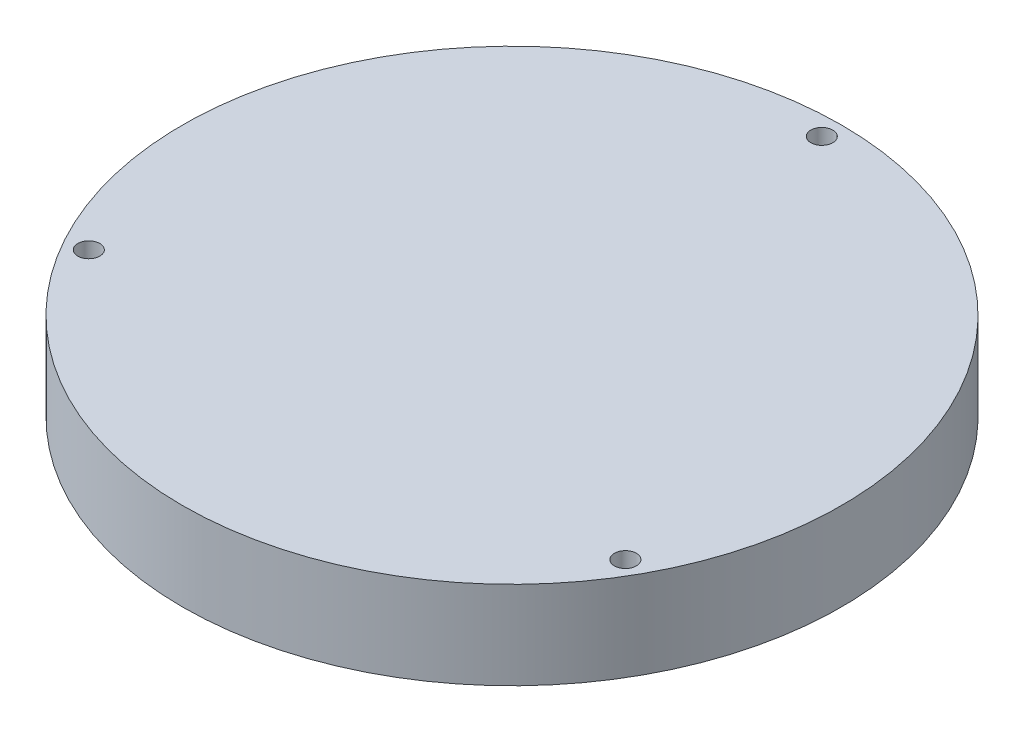
ISO-10303-21;
HEADER;
FILE_DESCRIPTION(('STEP AP214'),'2;1');
FILE_NAME('part.step','',(''),(''),'','','');
FILE_SCHEMA(('AUTOMOTIVE_DESIGN { 1 0 10303 214 1 1 1 1 }'));
ENDSEC;
DATA;
#1=APPLICATION_CONTEXT('core data for automotive mechanical design processes');
#2=APPLICATION_PROTOCOL_DEFINITION('international standard','automotive_design',2000,#1);
#3=PRODUCT_CONTEXT('',#1,'mechanical');
#4=PRODUCT('Part','Part','',(#3));
#5=PRODUCT_RELATED_PRODUCT_CATEGORY('part','',(#4));
#6=PRODUCT_DEFINITION_FORMATION('','',#4);
#7=PRODUCT_DEFINITION_CONTEXT('part definition',#1,'design');
#8=PRODUCT_DEFINITION('design','',#6,#7);
#9=PRODUCT_DEFINITION_SHAPE('','',#8);
#10=(LENGTH_UNIT() NAMED_UNIT(*) SI_UNIT(.MILLI.,.METRE.));
#11=(NAMED_UNIT(*) PLANE_ANGLE_UNIT() SI_UNIT($,.RADIAN.));
#12=(NAMED_UNIT(*) SI_UNIT($,.STERADIAN.) SOLID_ANGLE_UNIT());
#13=UNCERTAINTY_MEASURE_WITH_UNIT(LENGTH_MEASURE(1.E-05),#10,'distance_accuracy_value','');
#14=(GEOMETRIC_REPRESENTATION_CONTEXT(3) GLOBAL_UNCERTAINTY_ASSIGNED_CONTEXT((#13)) GLOBAL_UNIT_ASSIGNED_CONTEXT((#10,
#11,#12)) REPRESENTATION_CONTEXT('',''));
#15=CARTESIAN_POINT('',(0.,0.,0.));
#16=DIRECTION('',(0.,0.,1.));
#17=DIRECTION('',(1.,0.,0.));
#18=AXIS2_PLACEMENT_3D('',#15,#16,#17);
#19=CARTESIAN_POINT('',(0.,12.7,0.));
#20=DIRECTION('',(0.,-1.,0.));
#21=DIRECTION('',(0.,0.,-1.));
#22=AXIS2_PLACEMENT_3D('',#19,#20,#21);
#23=CYLINDRICAL_SURFACE('',#22,95.25);
#24=CARTESIAN_POINT('',(0.,12.7,0.));
#25=DIRECTION('',(0.,1.,0.));
#26=DIRECTION('',(0.,0.,1.));
#27=AXIS2_PLACEMENT_3D('',#24,#25,#26);
#28=CIRCLE('',#27,95.25);
#29=CARTESIAN_POINT('',(0.,12.7,95.25));
#30=VERTEX_POINT('',#29);
#31=EDGE_CURVE('E10',#30,#30,#28,.T.);
#32=ORIENTED_EDGE('',*,*,#31,.F.);
#33=EDGE_LOOP('',(#32));
#34=FACE_BOUND('',#33,.T.);
#35=CARTESIAN_POINT('',(0.,-12.7,0.));
#36=DIRECTION('',(0.,1.,0.));
#37=DIRECTION('',(0.,0.,1.));
#38=AXIS2_PLACEMENT_3D('',#35,#36,#37);
#39=CIRCLE('',#38,95.25);
#40=CARTESIAN_POINT('',(0.,-12.7,95.25));
#41=VERTEX_POINT('',#40);
#42=EDGE_CURVE('E40',#41,#41,#39,.T.);
#43=ORIENTED_EDGE('',*,*,#42,.T.);
#44=EDGE_LOOP('',(#43));
#45=FACE_BOUND('',#44,.T.);
#46=ADVANCED_FACE('F37',(#34,#45),#23,.T.);
#47=CARTESIAN_POINT('',(0.,12.7,0.));
#48=DIRECTION('',(0.,1.,0.));
#49=DIRECTION('',(0.,0.,1.));
#50=AXIS2_PLACEMENT_3D('',#47,#48,#49);
#51=PLANE('',#50);
#52=CARTESIAN_POINT('',(77.5395845278395,12.7,44.7675000000004));
#53=DIRECTION('',(0.,1.,0.));
#54=DIRECTION('',(-0.866025403784436,0.,-0.500000000000004));
#55=AXIS2_PLACEMENT_3D('',#52,#53,#54);
#56=CIRCLE('',#55,3.175);
#57=CARTESIAN_POINT('',(74.789953870824,12.7,43.1800000000004));
#58=VERTEX_POINT('',#57);
#59=EDGE_CURVE('E55',#58,#58,#56,.T.);
#60=ORIENTED_EDGE('',*,*,#59,.F.);
#61=EDGE_LOOP('',(#60));
#62=FACE_BOUND('',#61,.T.);
#63=CARTESIAN_POINT('',(-77.5395845278401,12.7,44.7674999999993));
#64=DIRECTION('',(0.,1.,0.));
#65=DIRECTION('',(0.866025403784443,0.,-0.499999999999992));
#66=AXIS2_PLACEMENT_3D('',#63,#64,#65);
#67=CIRCLE('',#66,3.175);
#68=CARTESIAN_POINT('',(-74.7899538708245,12.7,43.1799999999993));
#69=VERTEX_POINT('',#68);
#70=EDGE_CURVE('E59',#69,#69,#67,.T.);
#71=ORIENTED_EDGE('',*,*,#70,.F.);
#72=EDGE_LOOP('',(#71));
#73=FACE_BOUND('',#72,.T.);
#74=CARTESIAN_POINT('',(0.,12.7,-89.535));
#75=DIRECTION('',(0.,1.,0.));
#76=DIRECTION('',(0.,0.,1.));
#77=AXIS2_PLACEMENT_3D('',#74,#75,#76);
#78=CIRCLE('',#77,3.175);
#79=CARTESIAN_POINT('',(0.,12.7,-86.36));
#80=VERTEX_POINT('',#79);
#81=EDGE_CURVE('E51',#80,#80,#78,.T.);
#82=ORIENTED_EDGE('',*,*,#81,.F.);
#83=EDGE_LOOP('',(#82));
#84=FACE_BOUND('',#83,.T.);
#85=ORIENTED_EDGE('',*,*,#31,.T.);
#86=EDGE_LOOP('',(#85));
#87=FACE_BOUND('',#86,.T.);
#88=ADVANCED_FACE('F106',(#62,#73,#84,#87),#51,.T.);
#89=CARTESIAN_POINT('',(0.,-12.7,0.));
#90=DIRECTION('',(0.,1.,0.));
#91=DIRECTION('',(0.,0.,1.));
#92=AXIS2_PLACEMENT_3D('',#89,#90,#91);
#93=PLANE('',#92);
#94=CARTESIAN_POINT('',(-77.5395845278398,-12.7,-44.7674999999998));
#95=DIRECTION('',(0.,-1.,0.));
#96=DIRECTION('',(-0.866025403784436,0.,0.500000000000004));
#97=AXIS2_PLACEMENT_3D('',#94,#95,#96);
#98=CIRCLE('',#97,2.84479999999999);
#99=CARTESIAN_POINT('',(-80.0032535965258,-12.7,-43.3450999999998));
#100=VERTEX_POINT('',#99);
#101=EDGE_CURVE('E87',#100,#100,#98,.T.);
#102=ORIENTED_EDGE('',*,*,#101,.F.);
#103=EDGE_LOOP('',(#102));
#104=FACE_BOUND('',#103,.T.);
#105=CARTESIAN_POINT('',(6.24500451351651E-13,-12.7,89.535));
#106=DIRECTION('',(0.,-1.,0.));
#107=DIRECTION('',(0.866025403784443,0.,0.499999999999992));
#108=AXIS2_PLACEMENT_3D('',#105,#106,#107);
#109=CIRCLE('',#108,2.84479999999999);
#110=CARTESIAN_POINT('',(2.4636690686866,-12.7,90.9574));
#111=VERTEX_POINT('',#110);
#112=EDGE_CURVE('E88',#111,#111,#109,.T.);
#113=ORIENTED_EDGE('',*,*,#112,.F.);
#114=EDGE_LOOP('',(#113));
#115=FACE_BOUND('',#114,.T.);
#116=CARTESIAN_POINT('',(77.5395845278398,-12.7,-44.7674999999998));
#117=DIRECTION('',(0.,-1.,0.));
#118=DIRECTION('',(0.,0.,-1.));
#119=AXIS2_PLACEMENT_3D('',#116,#117,#118);
#120=CIRCLE('',#119,2.84479999999999);
#121=CARTESIAN_POINT('',(77.5395845278398,-12.7,-47.6122999999998));
#122=VERTEX_POINT('',#121);
#123=EDGE_CURVE('E78',#122,#122,#120,.T.);
#124=ORIENTED_EDGE('',*,*,#123,.F.);
#125=EDGE_LOOP('',(#124));
#126=FACE_BOUND('',#125,.T.);
#127=CARTESIAN_POINT('',(77.5395845278395,-12.7,44.7675000000004));
#128=DIRECTION('',(0.,1.,0.));
#129=DIRECTION('',(-0.866025403784436,0.,-0.500000000000004));
#130=AXIS2_PLACEMENT_3D('',#127,#128,#129);
#131=CIRCLE('',#130,3.175);
#132=CARTESIAN_POINT('',(74.789953870824,-12.7,43.1800000000004));
#133=VERTEX_POINT('',#132);
#134=EDGE_CURVE('E63',#133,#133,#131,.T.);
#135=ORIENTED_EDGE('',*,*,#134,.T.);
#136=EDGE_LOOP('',(#135));
#137=FACE_BOUND('',#136,.T.);
#138=CARTESIAN_POINT('',(-77.5395845278401,-12.7,44.7674999999993));
#139=DIRECTION('',(0.,1.,0.));
#140=DIRECTION('',(0.866025403784443,0.,-0.499999999999992));
#141=AXIS2_PLACEMENT_3D('',#138,#139,#140);
#142=CIRCLE('',#141,3.175);
#143=CARTESIAN_POINT('',(-74.7899538708245,-12.7,43.1799999999993));
#144=VERTEX_POINT('',#143);
#145=EDGE_CURVE('E64',#144,#144,#142,.T.);
#146=ORIENTED_EDGE('',*,*,#145,.T.);
#147=EDGE_LOOP('',(#146));
#148=FACE_BOUND('',#147,.T.);
#149=CARTESIAN_POINT('',(0.,-12.7,-89.535));
#150=DIRECTION('',(0.,1.,0.));
#151=DIRECTION('',(0.,0.,1.));
#152=AXIS2_PLACEMENT_3D('',#149,#150,#151);
#153=CIRCLE('',#152,3.175);
#154=CARTESIAN_POINT('',(0.,-12.7,-86.36));
#155=VERTEX_POINT('',#154);
#156=EDGE_CURVE('E49',#155,#155,#153,.T.);
#157=ORIENTED_EDGE('',*,*,#156,.T.);
#158=EDGE_LOOP('',(#157));
#159=FACE_BOUND('',#158,.T.);
#160=ORIENTED_EDGE('',*,*,#42,.F.);
#161=EDGE_LOOP('',(#160));
#162=FACE_BOUND('',#161,.T.);
#163=ADVANCED_FACE('F102',(#104,#115,#126,#137,#148,#159,#162),#93,.F.);
#164=CARTESIAN_POINT('',(0.,-12.7,-89.535));
#165=DIRECTION('',(0.,1.,0.));
#166=DIRECTION('',(0.,0.,1.));
#167=AXIS2_PLACEMENT_3D('',#164,#165,#166);
#168=CYLINDRICAL_SURFACE('',#167,3.175);
#169=ORIENTED_EDGE('',*,*,#156,.F.);
#170=EDGE_LOOP('',(#169));
#171=FACE_BOUND('',#170,.T.);
#172=ORIENTED_EDGE('',*,*,#81,.T.);
#173=EDGE_LOOP('',(#172));
#174=FACE_BOUND('',#173,.T.);
#175=ADVANCED_FACE('F105',(#171,#174),#168,.F.);
#176=CARTESIAN_POINT('',(-77.5395845278401,-12.7,44.7674999999993));
#177=DIRECTION('',(0.,1.,0.));
#178=DIRECTION('',(0.866025403784443,0.,-0.499999999999992));
#179=AXIS2_PLACEMENT_3D('',#176,#177,#178);
#180=CYLINDRICAL_SURFACE('',#179,3.175);
#181=ORIENTED_EDGE('',*,*,#145,.F.);
#182=EDGE_LOOP('',(#181));
#183=FACE_BOUND('',#182,.T.);
#184=ORIENTED_EDGE('',*,*,#70,.T.);
#185=EDGE_LOOP('',(#184));
#186=FACE_BOUND('',#185,.T.);
#187=ADVANCED_FACE('F133',(#183,#186),#180,.F.);
#188=CARTESIAN_POINT('',(77.5395845278395,-12.7,44.7675000000004));
#189=DIRECTION('',(0.,1.,0.));
#190=DIRECTION('',(-0.866025403784436,0.,-0.500000000000004));
#191=AXIS2_PLACEMENT_3D('',#188,#189,#190);
#192=CYLINDRICAL_SURFACE('',#191,3.175);
#193=ORIENTED_EDGE('',*,*,#134,.F.);
#194=EDGE_LOOP('',(#193));
#195=FACE_BOUND('',#194,.T.);
#196=ORIENTED_EDGE('',*,*,#59,.T.);
#197=EDGE_LOOP('',(#196));
#198=FACE_BOUND('',#197,.T.);
#199=ADVANCED_FACE('F137',(#195,#198),#192,.F.);
#200=CARTESIAN_POINT('',(0.,0.,0.));
#201=DIRECTION('',(0.,1.,0.));
#202=DIRECTION('',(0.,0.,1.));
#203=AXIS2_PLACEMENT_3D('',#200,#201,#202);
#204=PLANE('',#203);
#205=CARTESIAN_POINT('',(77.5395845278398,0.,-44.7674999999998));
#206=DIRECTION('',(0.,1.,0.));
#207=DIRECTION('',(0.,0.,1.));
#208=AXIS2_PLACEMENT_3D('',#205,#206,#207);
#209=CIRCLE('',#208,2.84479999999999);
#210=CARTESIAN_POINT('',(77.5395845278398,0.,-41.9226999999998));
#211=VERTEX_POINT('',#210);
#212=EDGE_CURVE('E68',#211,#211,#209,.F.);
#213=ORIENTED_EDGE('',*,*,#212,.T.);
#214=EDGE_LOOP('',(#213));
#215=FACE_BOUND('',#214,.T.);
#216=ADVANCED_FACE('F141',(#215),#204,.F.);
#217=CARTESIAN_POINT('',(77.5395845278398,8.04630948447792,-44.7674999999998));
#218=DIRECTION('',(0.,-1.,0.));
#219=DIRECTION('',(0.,0.,-1.));
#220=AXIS2_PLACEMENT_3D('',#217,#218,#219);
#221=CYLINDRICAL_SURFACE('',#220,2.84479999999999);
#222=ORIENTED_EDGE('',*,*,#123,.T.);
#223=EDGE_LOOP('',(#222));
#224=FACE_BOUND('',#223,.T.);
#225=ORIENTED_EDGE('',*,*,#212,.F.);
#226=EDGE_LOOP('',(#225));
#227=FACE_BOUND('',#226,.T.);
#228=ADVANCED_FACE('F145',(#224,#227),#221,.F.);
#229=CARTESIAN_POINT('',(0.,0.,0.));
#230=DIRECTION('',(0.,1.,0.));
#231=DIRECTION('',(-0.866025403784443,0.,-0.499999999999992));
#232=AXIS2_PLACEMENT_3D('',#229,#230,#231);
#233=PLANE('',#232);
#234=CARTESIAN_POINT('',(6.24500451351651E-13,0.,89.535));
#235=DIRECTION('',(0.,1.,0.));
#236=DIRECTION('',(-0.866025403784443,0.,-0.499999999999992));
#237=AXIS2_PLACEMENT_3D('',#234,#235,#236);
#238=CIRCLE('',#237,2.84479999999999);
#239=CARTESIAN_POINT('',(-2.46366906868535,0.,88.1126));
#240=VERTEX_POINT('',#239);
#241=EDGE_CURVE('E83',#240,#240,#238,.F.);
#242=ORIENTED_EDGE('',*,*,#241,.T.);
#243=EDGE_LOOP('',(#242));
#244=FACE_BOUND('',#243,.T.);
#245=ADVANCED_FACE('F149',(#244),#233,.F.);
#246=CARTESIAN_POINT('',(6.24500451351651E-13,8.04630948447792,89.535));
#247=DIRECTION('',(0.,-1.,0.));
#248=DIRECTION('',(0.866025403784443,0.,0.499999999999992));
#249=AXIS2_PLACEMENT_3D('',#246,#247,#248);
#250=CYLINDRICAL_SURFACE('',#249,2.84479999999999);
#251=ORIENTED_EDGE('',*,*,#112,.T.);
#252=EDGE_LOOP('',(#251));
#253=FACE_BOUND('',#252,.T.);
#254=ORIENTED_EDGE('',*,*,#241,.F.);
#255=EDGE_LOOP('',(#254));
#256=FACE_BOUND('',#255,.T.);
#257=ADVANCED_FACE('F153',(#253,#256),#250,.F.);
#258=CARTESIAN_POINT('',(0.,0.,0.));
#259=DIRECTION('',(0.,1.,0.));
#260=DIRECTION('',(0.866025403784436,0.,-0.500000000000004));
#261=AXIS2_PLACEMENT_3D('',#258,#259,#260);
#262=PLANE('',#261);
#263=CARTESIAN_POINT('',(-77.5395845278398,0.,-44.7674999999998));
#264=DIRECTION('',(0.,1.,0.));
#265=DIRECTION('',(0.866025403784436,0.,-0.500000000000004));
#266=AXIS2_PLACEMENT_3D('',#263,#264,#265);
#267=CIRCLE('',#266,2.84479999999999);
#268=CARTESIAN_POINT('',(-75.0759154591539,0.,-46.1898999999998));
#269=VERTEX_POINT('',#268);
#270=EDGE_CURVE('E82',#269,#269,#267,.F.);
#271=ORIENTED_EDGE('',*,*,#270,.T.);
#272=EDGE_LOOP('',(#271));
#273=FACE_BOUND('',#272,.T.);
#274=ADVANCED_FACE('F157',(#273),#262,.F.);
#275=CARTESIAN_POINT('',(-77.5395845278398,8.04630948447792,-44.7674999999998));
#276=DIRECTION('',(0.,-1.,0.));
#277=DIRECTION('',(-0.866025403784436,0.,0.500000000000004));
#278=AXIS2_PLACEMENT_3D('',#275,#276,#277);
#279=CYLINDRICAL_SURFACE('',#278,2.84479999999999);
#280=ORIENTED_EDGE('',*,*,#101,.T.);
#281=EDGE_LOOP('',(#280));
#282=FACE_BOUND('',#281,.T.);
#283=ORIENTED_EDGE('',*,*,#270,.F.);
#284=EDGE_LOOP('',(#283));
#285=FACE_BOUND('',#284,.T.);
#286=ADVANCED_FACE('F99',(#282,#285),#279,.F.);
#287=CLOSED_SHELL('',(#46,#88,#163,#175,#187,#199,#216,#228,#245,#257,#274,#286));
#288=MANIFOLD_SOLID_BREP('B2',#287);
#289=ADVANCED_BREP_SHAPE_REPRESENTATION('',(#18,#288),#14);
#290=SHAPE_DEFINITION_REPRESENTATION(#9,#289);
ENDSEC;
END-ISO-10303-21;
